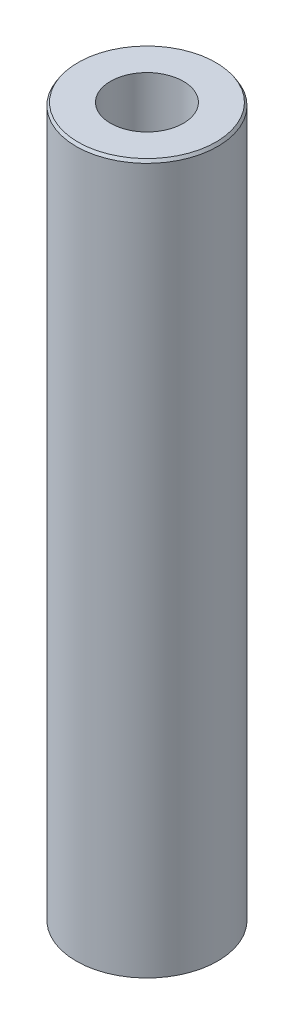
ISO-10303-21;
HEADER;
FILE_DESCRIPTION(('STEP AP214'),'2;1');
FILE_NAME('part.step','',(''),(''),'','','');
FILE_SCHEMA(('AUTOMOTIVE_DESIGN { 1 0 10303 214 1 1 1 1 }'));
ENDSEC;
DATA;
#1=APPLICATION_CONTEXT('core data for automotive mechanical design processes');
#2=APPLICATION_PROTOCOL_DEFINITION('international standard','automotive_design',2000,#1);
#3=PRODUCT_CONTEXT('',#1,'mechanical');
#4=PRODUCT('Part','Part','',(#3));
#5=PRODUCT_RELATED_PRODUCT_CATEGORY('part','',(#4));
#6=PRODUCT_DEFINITION_FORMATION('','',#4);
#7=PRODUCT_DEFINITION_CONTEXT('part definition',#1,'design');
#8=PRODUCT_DEFINITION('design','',#6,#7);
#9=PRODUCT_DEFINITION_SHAPE('','',#8);
#10=(LENGTH_UNIT() NAMED_UNIT(*) SI_UNIT(.MILLI.,.METRE.));
#11=(NAMED_UNIT(*) PLANE_ANGLE_UNIT() SI_UNIT($,.RADIAN.));
#12=(NAMED_UNIT(*) SI_UNIT($,.STERADIAN.) SOLID_ANGLE_UNIT());
#13=UNCERTAINTY_MEASURE_WITH_UNIT(LENGTH_MEASURE(1.E-05),#10,'distance_accuracy_value','');
#14=(GEOMETRIC_REPRESENTATION_CONTEXT(3) GLOBAL_UNCERTAINTY_ASSIGNED_CONTEXT((#13)) GLOBAL_UNIT_ASSIGNED_CONTEXT((#10,
#11,#12)) REPRESENTATION_CONTEXT('',''));
#15=CARTESIAN_POINT('',(0.,0.,0.));
#16=DIRECTION('',(0.,0.,1.));
#17=DIRECTION('',(1.,0.,0.));
#18=AXIS2_PLACEMENT_3D('',#15,#16,#17);
#19=CARTESIAN_POINT('',(0.,275.91650375279,0.));
#20=DIRECTION('',(0.,-1.,0.));
#21=DIRECTION('',(0.,0.,-1.));
#22=AXIS2_PLACEMENT_3D('',#19,#20,#21);
#23=CYLINDRICAL_SURFACE('',#22,27.5);
#24=CARTESIAN_POINT('',(0.,274.804689602383,0.));
#25=DIRECTION('',(0.,1.,0.));
#26=DIRECTION('',(0.,0.,1.));
#27=AXIS2_PLACEMENT_3D('',#24,#25,#26);
#28=CIRCLE('',#27,27.5);
#29=CARTESIAN_POINT('',(0.,274.804689602383,27.5));
#30=VERTEX_POINT('',#29);
#31=EDGE_CURVE('E50',#30,#30,#28,.F.);
#32=ORIENTED_EDGE('',*,*,#31,.T.);
#33=EDGE_LOOP('',(#32));
#34=FACE_BOUND('',#33,.T.);
#35=CARTESIAN_POINT('',(0.,0.714497341523845,0.));
#36=DIRECTION('',(0.,1.,0.));
#37=DIRECTION('',(0.,0.,1.));
#38=AXIS2_PLACEMENT_3D('',#35,#36,#37);
#39=CIRCLE('',#38,27.5);
#40=CARTESIAN_POINT('',(0.,0.714497341523845,27.5));
#41=VERTEX_POINT('',#40);
#42=EDGE_CURVE('E51',#41,#41,#39,.T.);
#43=ORIENTED_EDGE('',*,*,#42,.T.);
#44=EDGE_LOOP('',(#43));
#45=FACE_BOUND('',#44,.T.);
#46=ADVANCED_FACE('F39',(#34,#45),#23,.T.);
#47=CARTESIAN_POINT('',(0.,275.91650375279,0.));
#48=DIRECTION('',(0.,1.,0.));
#49=DIRECTION('',(0.,0.,1.));
#50=AXIS2_PLACEMENT_3D('',#47,#48,#49);
#51=PLANE('',#50);
#52=CARTESIAN_POINT('',(0.,275.91650375279,0.));
#53=DIRECTION('',(0.,1.,0.));
#54=DIRECTION('',(0.,0.,1.));
#55=AXIS2_PLACEMENT_3D('',#52,#53,#54);
#56=CIRCLE('',#55,26.7855026584762);
#57=CARTESIAN_POINT('',(0.,275.91650375279,26.7855026584762));
#58=VERTEX_POINT('',#57);
#59=EDGE_CURVE('E54',#58,#58,#56,.T.);
#60=ORIENTED_EDGE('',*,*,#59,.T.);
#61=EDGE_LOOP('',(#60));
#62=FACE_BOUND('',#61,.T.);
#63=CARTESIAN_POINT('',(0.,275.91650375279,0.));
#64=DIRECTION('',(0.,1.,0.));
#65=DIRECTION('',(0.,0.,1.));
#66=AXIS2_PLACEMENT_3D('',#63,#64,#65);
#67=CIRCLE('',#66,14.1528496749494);
#68=CARTESIAN_POINT('',(0.,275.91650375279,14.1528496749494));
#69=VERTEX_POINT('',#68);
#70=EDGE_CURVE('E58',#69,#69,#67,.T.);
#71=ORIENTED_EDGE('',*,*,#70,.F.);
#72=EDGE_LOOP('',(#71));
#73=FACE_BOUND('',#72,.T.);
#74=ADVANCED_FACE('F69',(#62,#73),#51,.T.);
#75=CARTESIAN_POINT('',(0.,0.,0.));
#76=DIRECTION('',(0.,1.,0.));
#77=DIRECTION('',(0.,0.,1.));
#78=AXIS2_PLACEMENT_3D('',#75,#76,#77);
#79=PLANE('',#78);
#80=CARTESIAN_POINT('',(0.,0.,0.));
#81=DIRECTION('',(0.,1.,0.));
#82=DIRECTION('',(0.,0.,1.));
#83=AXIS2_PLACEMENT_3D('',#80,#81,#82);
#84=CIRCLE('',#83,26.3881858495929);
#85=CARTESIAN_POINT('',(0.,0.,26.3881858495929));
#86=VERTEX_POINT('',#85);
#87=EDGE_CURVE('E10',#86,#86,#84,.F.);
#88=ORIENTED_EDGE('',*,*,#87,.T.);
#89=EDGE_LOOP('',(#88));
#90=FACE_BOUND('',#89,.T.);
#91=CARTESIAN_POINT('',(0.,0.,0.));
#92=DIRECTION('',(0.,1.,0.));
#93=DIRECTION('',(0.,0.,1.));
#94=AXIS2_PLACEMENT_3D('',#91,#92,#93);
#95=CIRCLE('',#94,14.1528496749494);
#96=CARTESIAN_POINT('',(0.,0.,14.1528496749494));
#97=VERTEX_POINT('',#96);
#98=EDGE_CURVE('E63',#97,#97,#95,.T.);
#99=ORIENTED_EDGE('',*,*,#98,.T.);
#100=EDGE_LOOP('',(#99));
#101=FACE_BOUND('',#100,.T.);
#102=ADVANCED_FACE('F75',(#90,#101),#79,.F.);
#103=CARTESIAN_POINT('',(0.,275.91650375279,0.));
#104=DIRECTION('',(0.,-1.,0.));
#105=DIRECTION('',(0.,0.,-1.));
#106=AXIS2_PLACEMENT_3D('',#103,#104,#105);
#107=CYLINDRICAL_SURFACE('',#106,14.1528496749494);
#108=ORIENTED_EDGE('',*,*,#70,.T.);
#109=EDGE_LOOP('',(#108));
#110=FACE_BOUND('',#109,.T.);
#111=ORIENTED_EDGE('',*,*,#98,.F.);
#112=EDGE_LOOP('',(#111));
#113=FACE_BOUND('',#112,.T.);
#114=ADVANCED_FACE('F70',(#110,#113),#107,.F.);
#115=CARTESIAN_POINT('',(0.,275.91650375279,0.));
#116=DIRECTION('',(0.,-1.,0.));
#117=DIRECTION('',(0.,0.,-1.));
#118=AXIS2_PLACEMENT_3D('',#115,#116,#117);
#119=CONICAL_SURFACE('',#118,26.7855026584762,0.571184516042447);
#120=ORIENTED_EDGE('',*,*,#31,.F.);
#121=EDGE_LOOP('',(#120));
#122=FACE_BOUND('',#121,.T.);
#123=ORIENTED_EDGE('',*,*,#59,.F.);
#124=EDGE_LOOP('',(#123));
#125=FACE_BOUND('',#124,.T.);
#126=ADVANCED_FACE('F81',(#122,#125),#119,.T.);
#127=CARTESIAN_POINT('',(0.,0.714497341523845,0.));
#128=DIRECTION('',(0.,1.,0.));
#129=DIRECTION('',(0.,0.,1.));
#130=AXIS2_PLACEMENT_3D('',#127,#128,#129);
#131=CONICAL_SURFACE('',#130,27.5,0.999611810752416);
#132=ORIENTED_EDGE('',*,*,#87,.F.);
#133=EDGE_LOOP('',(#132));
#134=FACE_BOUND('',#133,.T.);
#135=ORIENTED_EDGE('',*,*,#42,.F.);
#136=EDGE_LOOP('',(#135));
#137=FACE_BOUND('',#136,.T.);
#138=ADVANCED_FACE('F45',(#134,#137),#131,.T.);
#139=CLOSED_SHELL('',(#46,#74,#102,#114,#126,#138));
#140=MANIFOLD_SOLID_BREP('B2',#139);
#141=ADVANCED_BREP_SHAPE_REPRESENTATION('',(#18,#140),#14);
#142=SHAPE_DEFINITION_REPRESENTATION(#9,#141);
ENDSEC;
END-ISO-10303-21;
